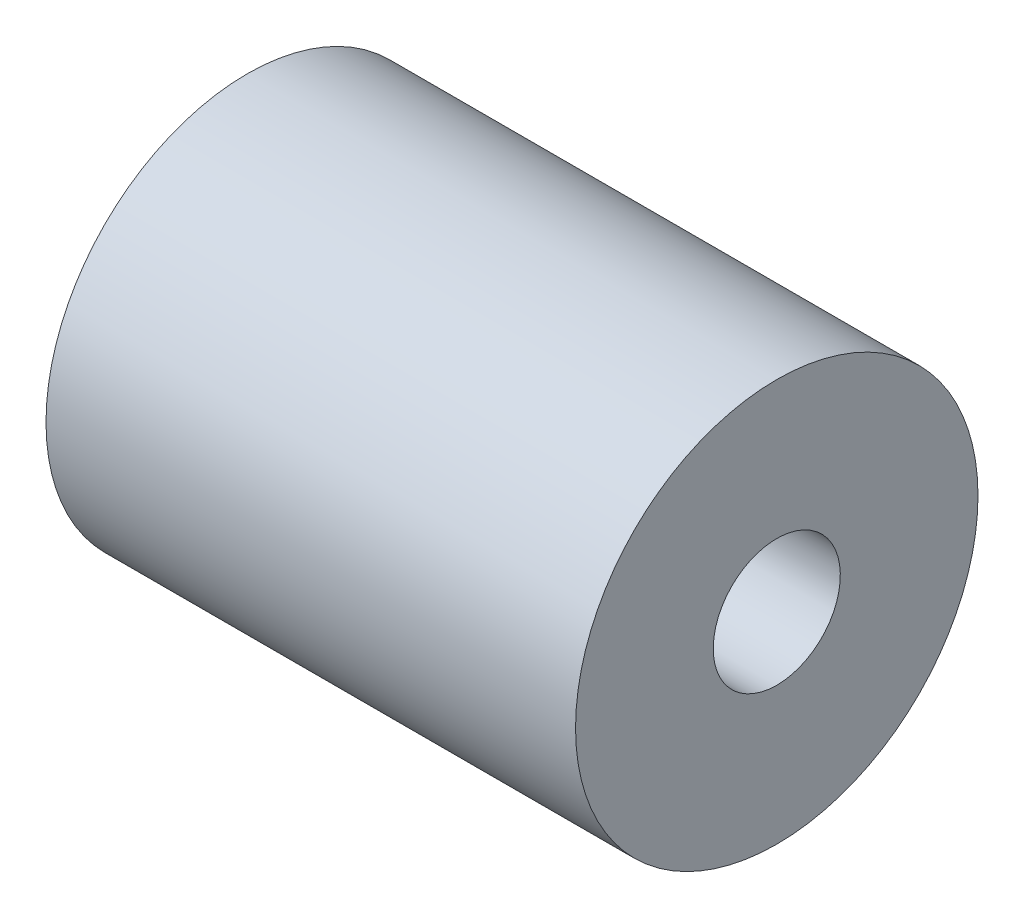
ISO-10303-21;
HEADER;
FILE_DESCRIPTION(('STEP AP214'),'2;1');
FILE_NAME('part.step','',(''),(''),'','','');
FILE_SCHEMA(('AUTOMOTIVE_DESIGN { 1 0 10303 214 1 1 1 1 }'));
ENDSEC;
DATA;
#1=APPLICATION_CONTEXT('core data for automotive mechanical design processes');
#2=APPLICATION_PROTOCOL_DEFINITION('international standard','automotive_design',2000,#1);
#3=PRODUCT_CONTEXT('',#1,'mechanical');
#4=PRODUCT('Part','Part','',(#3));
#5=PRODUCT_RELATED_PRODUCT_CATEGORY('part','',(#4));
#6=PRODUCT_DEFINITION_FORMATION('','',#4);
#7=PRODUCT_DEFINITION_CONTEXT('part definition',#1,'design');
#8=PRODUCT_DEFINITION('design','',#6,#7);
#9=PRODUCT_DEFINITION_SHAPE('','',#8);
#10=(LENGTH_UNIT() NAMED_UNIT(*) SI_UNIT(.MILLI.,.METRE.));
#11=(NAMED_UNIT(*) PLANE_ANGLE_UNIT() SI_UNIT($,.RADIAN.));
#12=(NAMED_UNIT(*) SI_UNIT($,.STERADIAN.) SOLID_ANGLE_UNIT());
#13=UNCERTAINTY_MEASURE_WITH_UNIT(LENGTH_MEASURE(1.E-05),#10,'distance_accuracy_value','');
#14=(GEOMETRIC_REPRESENTATION_CONTEXT(3) GLOBAL_UNCERTAINTY_ASSIGNED_CONTEXT((#13)) GLOBAL_UNIT_ASSIGNED_CONTEXT((#10,
#11,#12)) REPRESENTATION_CONTEXT('',''));
#15=CARTESIAN_POINT('',(0.,0.,0.));
#16=DIRECTION('',(0.,0.,1.));
#17=DIRECTION('',(1.,0.,0.));
#18=AXIS2_PLACEMENT_3D('',#15,#16,#17);
#19=CARTESIAN_POINT('',(-12.5,0.,0.));
#20=DIRECTION('',(-1.,0.,0.));
#21=DIRECTION('',(0.,-1.,0.));
#22=AXIS2_PLACEMENT_3D('',#19,#20,#21);
#23=CYLINDRICAL_SURFACE('',#22,3.);
#24=CARTESIAN_POINT('',(12.5,0.,0.));
#25=DIRECTION('',(-1.,0.,0.));
#26=DIRECTION('',(0.,-1.,0.));
#27=AXIS2_PLACEMENT_3D('',#24,#25,#26);
#28=CIRCLE('',#27,3.);
#29=CARTESIAN_POINT('',(12.5,-2.99999999999999,0.));
#30=VERTEX_POINT('',#29);
#31=EDGE_CURVE('E53',#30,#30,#28,.T.);
#32=ORIENTED_EDGE('',*,*,#31,.F.);
#33=EDGE_LOOP('',(#32));
#34=FACE_BOUND('',#33,.T.);
#35=CARTESIAN_POINT('',(1.41138214480486,0.,0.));
#36=DIRECTION('',(-1.,0.,0.));
#37=DIRECTION('',(0.,-1.,0.));
#38=AXIS2_PLACEMENT_3D('',#35,#36,#37);
#39=CIRCLE('',#38,3.);
#40=CARTESIAN_POINT('',(1.41138214480486,-2.99999999999999,0.));
#41=VERTEX_POINT('',#40);
#42=EDGE_CURVE('E10',#41,#41,#39,.T.);
#43=ORIENTED_EDGE('',*,*,#42,.T.);
#44=EDGE_LOOP('',(#43));
#45=FACE_BOUND('',#44,.T.);
#46=ADVANCED_FACE('F31',(#34,#45),#23,.F.);
#47=CARTESIAN_POINT('',(1.41138214480486,3.,0.));
#48=DIRECTION('',(1.,0.,0.));
#49=DIRECTION('',(0.,1.,0.));
#50=AXIS2_PLACEMENT_3D('',#47,#48,#49);
#51=PLANE('',#50);
#52=ORIENTED_EDGE('',*,*,#42,.F.);
#53=EDGE_LOOP('',(#52));
#54=FACE_BOUND('',#53,.T.);
#55=CARTESIAN_POINT('',(1.41138214480486,0.,0.));
#56=DIRECTION('',(-1.,0.,0.));
#57=DIRECTION('',(0.,-1.,0.));
#58=AXIS2_PLACEMENT_3D('',#55,#56,#57);
#59=CIRCLE('',#58,4.);
#60=CARTESIAN_POINT('',(1.41138214480486,-3.99999999999999,0.));
#61=VERTEX_POINT('',#60);
#62=EDGE_CURVE('E37',#61,#61,#59,.T.);
#63=ORIENTED_EDGE('',*,*,#62,.T.);
#64=EDGE_LOOP('',(#63));
#65=FACE_BOUND('',#64,.T.);
#66=ADVANCED_FACE('F60',(#54,#65),#51,.F.);
#67=CARTESIAN_POINT('',(-12.5,0.,0.));
#68=DIRECTION('',(-1.,0.,0.));
#69=DIRECTION('',(0.,-1.,0.));
#70=AXIS2_PLACEMENT_3D('',#67,#68,#69);
#71=CYLINDRICAL_SURFACE('',#70,4.);
#72=ORIENTED_EDGE('',*,*,#62,.F.);
#73=EDGE_LOOP('',(#72));
#74=FACE_BOUND('',#73,.T.);
#75=CARTESIAN_POINT('',(-12.5,0.,0.));
#76=DIRECTION('',(-1.,0.,0.));
#77=DIRECTION('',(0.,-1.,0.));
#78=AXIS2_PLACEMENT_3D('',#75,#76,#77);
#79=CIRCLE('',#78,4.);
#80=CARTESIAN_POINT('',(-12.5,-4.,0.));
#81=VERTEX_POINT('',#80);
#82=EDGE_CURVE('E41',#81,#81,#79,.T.);
#83=ORIENTED_EDGE('',*,*,#82,.T.);
#84=EDGE_LOOP('',(#83));
#85=FACE_BOUND('',#84,.T.);
#86=ADVANCED_FACE('F64',(#74,#85),#71,.F.);
#87=CARTESIAN_POINT('',(-12.5,9.5,0.));
#88=DIRECTION('',(1.,0.,0.));
#89=DIRECTION('',(0.,1.,0.));
#90=AXIS2_PLACEMENT_3D('',#87,#88,#89);
#91=PLANE('',#90);
#92=ORIENTED_EDGE('',*,*,#82,.F.);
#93=EDGE_LOOP('',(#92));
#94=FACE_BOUND('',#93,.T.);
#95=CARTESIAN_POINT('',(-12.5,0.,0.));
#96=DIRECTION('',(-1.,0.,0.));
#97=DIRECTION('',(0.,-1.,0.));
#98=AXIS2_PLACEMENT_3D('',#95,#96,#97);
#99=CIRCLE('',#98,9.5);
#100=CARTESIAN_POINT('',(-12.5,-9.5,0.));
#101=VERTEX_POINT('',#100);
#102=EDGE_CURVE('E45',#101,#101,#99,.T.);
#103=ORIENTED_EDGE('',*,*,#102,.T.);
#104=EDGE_LOOP('',(#103));
#105=FACE_BOUND('',#104,.T.);
#106=ADVANCED_FACE('F69',(#94,#105),#91,.F.);
#107=CARTESIAN_POINT('',(-12.5,0.,0.));
#108=DIRECTION('',(-1.,0.,0.));
#109=DIRECTION('',(0.,-1.,0.));
#110=AXIS2_PLACEMENT_3D('',#107,#108,#109);
#111=CYLINDRICAL_SURFACE('',#110,9.49999999999999);
#112=ORIENTED_EDGE('',*,*,#102,.F.);
#113=EDGE_LOOP('',(#112));
#114=FACE_BOUND('',#113,.T.);
#115=CARTESIAN_POINT('',(12.5,0.,0.));
#116=DIRECTION('',(-1.,0.,0.));
#117=DIRECTION('',(0.,-1.,0.));
#118=AXIS2_PLACEMENT_3D('',#115,#116,#117);
#119=CIRCLE('',#118,9.49999999999999);
#120=CARTESIAN_POINT('',(12.5,-9.49999999999999,0.));
#121=VERTEX_POINT('',#120);
#122=EDGE_CURVE('E50',#121,#121,#119,.T.);
#123=ORIENTED_EDGE('',*,*,#122,.T.);
#124=EDGE_LOOP('',(#123));
#125=FACE_BOUND('',#124,.T.);
#126=ADVANCED_FACE('F75',(#114,#125),#111,.T.);
#127=CARTESIAN_POINT('',(12.5,3.,0.));
#128=DIRECTION('',(-1.,0.,0.));
#129=DIRECTION('',(0.,-1.,0.));
#130=AXIS2_PLACEMENT_3D('',#127,#128,#129);
#131=PLANE('',#130);
#132=ORIENTED_EDGE('',*,*,#122,.F.);
#133=EDGE_LOOP('',(#132));
#134=FACE_BOUND('',#133,.T.);
#135=ORIENTED_EDGE('',*,*,#31,.T.);
#136=EDGE_LOOP('',(#135));
#137=FACE_BOUND('',#136,.T.);
#138=ADVANCED_FACE('F57',(#134,#137),#131,.F.);
#139=CLOSED_SHELL('',(#46,#66,#86,#106,#126,#138));
#140=MANIFOLD_SOLID_BREP('B2',#139);
#141=ADVANCED_BREP_SHAPE_REPRESENTATION('',(#18,#140),#14);
#142=SHAPE_DEFINITION_REPRESENTATION(#9,#141);
ENDSEC;
END-ISO-10303-21;
